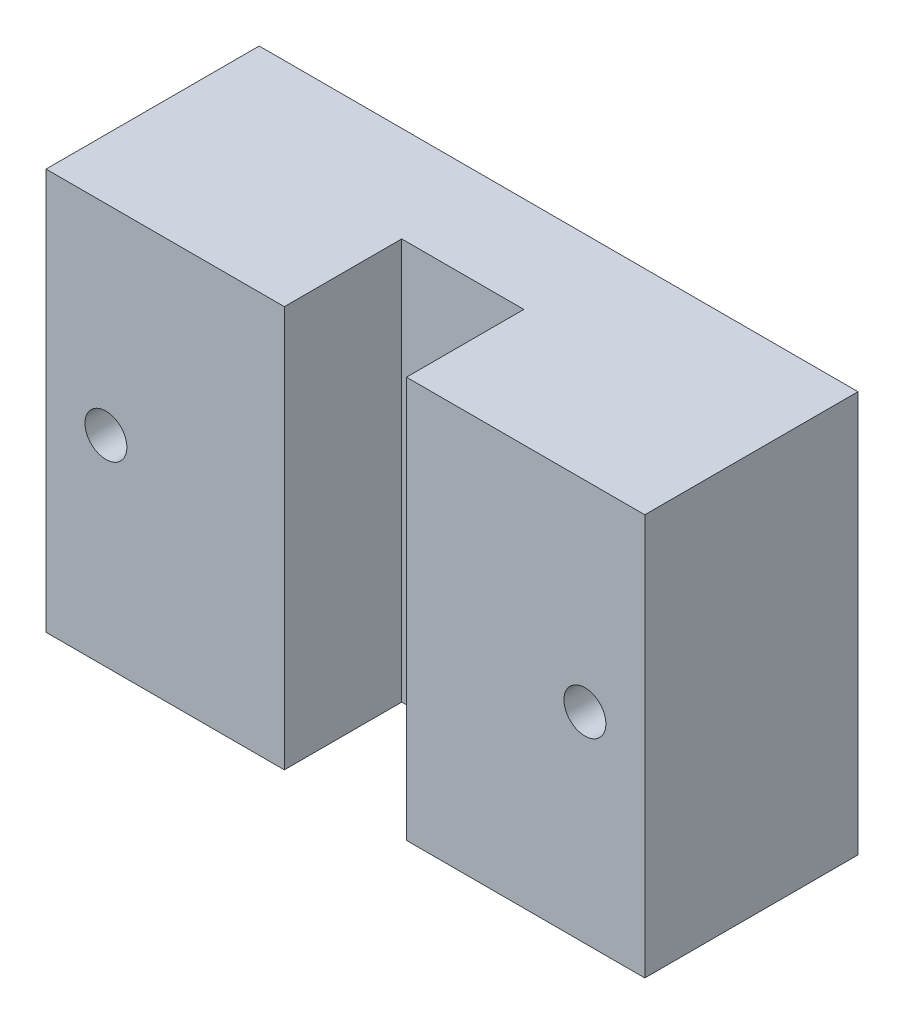
ISO-10303-21;
HEADER;
FILE_DESCRIPTION(('STEP AP214'),'2;1');
FILE_NAME('part.step','',(''),(''),'','','');
FILE_SCHEMA(('AUTOMOTIVE_DESIGN { 1 0 10303 214 1 1 1 1 }'));
ENDSEC;
DATA;
#1=APPLICATION_CONTEXT('core data for automotive mechanical design processes');
#2=APPLICATION_PROTOCOL_DEFINITION('international standard','automotive_design',2000,#1);
#3=PRODUCT_CONTEXT('',#1,'mechanical');
#4=PRODUCT('Part','Part','',(#3));
#5=PRODUCT_RELATED_PRODUCT_CATEGORY('part','',(#4));
#6=PRODUCT_DEFINITION_FORMATION('','',#4);
#7=PRODUCT_DEFINITION_CONTEXT('part definition',#1,'design');
#8=PRODUCT_DEFINITION('design','',#6,#7);
#9=PRODUCT_DEFINITION_SHAPE('','',#8);
#10=(LENGTH_UNIT() NAMED_UNIT(*) SI_UNIT(.MILLI.,.METRE.));
#11=(NAMED_UNIT(*) PLANE_ANGLE_UNIT() SI_UNIT($,.RADIAN.));
#12=(NAMED_UNIT(*) SI_UNIT($,.STERADIAN.) SOLID_ANGLE_UNIT());
#13=UNCERTAINTY_MEASURE_WITH_UNIT(LENGTH_MEASURE(1.E-05),#10,'distance_accuracy_value','');
#14=(GEOMETRIC_REPRESENTATION_CONTEXT(3) GLOBAL_UNCERTAINTY_ASSIGNED_CONTEXT((#13)) GLOBAL_UNIT_ASSIGNED_CONTEXT((#10,
#11,#12)) REPRESENTATION_CONTEXT('',''));
#15=CARTESIAN_POINT('',(0.,0.,0.));
#16=DIRECTION('',(0.,0.,1.));
#17=DIRECTION('',(1.,0.,0.));
#18=AXIS2_PLACEMENT_3D('',#15,#16,#17);
#19=CARTESIAN_POINT('',(0.,0.,8.));
#20=DIRECTION('',(0.,0.,1.));
#21=DIRECTION('',(1.,0.,0.));
#22=AXIS2_PLACEMENT_3D('',#19,#20,#21);
#23=PLANE('',#22);
#24=DIRECTION('',(0.,-1.,0.));
#25=VECTOR('',#24,1.);
#26=CARTESIAN_POINT('',(-5.1,69.8239107283418,8.));
#27=LINE('',#26,#25);
#28=CARTESIAN_POINT('',(-5.1,16.75,8.));
#29=VERTEX_POINT('',#28);
#30=CARTESIAN_POINT('',(-5.1,-16.75,8.));
#31=VERTEX_POINT('',#30);
#32=EDGE_CURVE('E55',#29,#31,#27,.T.);
#33=ORIENTED_EDGE('',*,*,#32,.T.);
#34=DIRECTION('',(1.,0.,0.));
#35=VECTOR('',#34,1.);
#36=CARTESIAN_POINT('',(25.,-16.75,8.));
#37=LINE('',#36,#35);
#38=CARTESIAN_POINT('',(5.1,-16.75,8.));
#39=VERTEX_POINT('',#38);
#40=EDGE_CURVE('E50',#31,#39,#37,.T.);
#41=ORIENTED_EDGE('',*,*,#40,.T.);
#42=DIRECTION('',(0.,-1.,0.));
#43=VECTOR('',#42,1.);
#44=CARTESIAN_POINT('',(5.1,69.8239107283418,8.));
#45=LINE('',#44,#43);
#46=CARTESIAN_POINT('',(5.1,16.75,8.));
#47=VERTEX_POINT('',#46);
#48=EDGE_CURVE('E143',#47,#39,#45,.T.);
#49=ORIENTED_EDGE('',*,*,#48,.F.);
#50=DIRECTION('',(-1.,0.,0.));
#51=VECTOR('',#50,1.);
#52=CARTESIAN_POINT('',(25.,16.75,8.));
#53=LINE('',#52,#51);
#54=EDGE_CURVE('E154',#47,#29,#53,.T.);
#55=ORIENTED_EDGE('',*,*,#54,.T.);
#56=EDGE_LOOP('',(#33,#41,#49,#55));
#57=FACE_BOUND('',#56,.T.);
#58=ADVANCED_FACE('F35',(#57),#23,.T.);
#59=CARTESIAN_POINT('',(0.,0.,0.));
#60=DIRECTION('',(0.,0.,1.));
#61=DIRECTION('',(1.,0.,0.));
#62=AXIS2_PLACEMENT_3D('',#59,#60,#61);
#63=PLANE('',#62);
#64=DIRECTION('',(0.,-1.,0.));
#65=VECTOR('',#64,1.);
#66=CARTESIAN_POINT('',(-25.,-16.75,0.));
#67=LINE('',#66,#65);
#68=CARTESIAN_POINT('',(-25.,16.75,0.));
#69=VERTEX_POINT('',#68);
#70=CARTESIAN_POINT('',(-25.,-16.75,0.));
#71=VERTEX_POINT('',#70);
#72=EDGE_CURVE('E152',#69,#71,#67,.T.);
#73=ORIENTED_EDGE('',*,*,#72,.F.);
#74=DIRECTION('',(-1.,0.,0.));
#75=VECTOR('',#74,1.);
#76=CARTESIAN_POINT('',(25.,16.75,0.));
#77=LINE('',#76,#75);
#78=CARTESIAN_POINT('',(25.,16.75,0.));
#79=VERTEX_POINT('',#78);
#80=EDGE_CURVE('E155',#79,#69,#77,.T.);
#81=ORIENTED_EDGE('',*,*,#80,.F.);
#82=DIRECTION('',(0.,1.,0.));
#83=VECTOR('',#82,1.);
#84=CARTESIAN_POINT('',(25.,-16.75,0.));
#85=LINE('',#84,#83);
#86=CARTESIAN_POINT('',(25.,-16.75,0.));
#87=VERTEX_POINT('',#86);
#88=EDGE_CURVE('E161',#87,#79,#85,.T.);
#89=ORIENTED_EDGE('',*,*,#88,.F.);
#90=DIRECTION('',(1.,0.,0.));
#91=VECTOR('',#90,1.);
#92=CARTESIAN_POINT('',(25.,-16.75,0.));
#93=LINE('',#92,#91);
#94=EDGE_CURVE('E103',#71,#87,#93,.T.);
#95=ORIENTED_EDGE('',*,*,#94,.F.);
#96=EDGE_LOOP('',(#73,#81,#89,#95));
#97=FACE_BOUND('',#96,.T.);
#98=CARTESIAN_POINT('',(-20.,0.,0.));
#99=DIRECTION('',(0.,0.,1.));
#100=DIRECTION('',(1.,0.,0.));
#101=AXIS2_PLACEMENT_3D('',#98,#99,#100);
#102=CIRCLE('',#101,1.75);
#103=CARTESIAN_POINT('',(-18.25,0.,0.));
#104=VERTEX_POINT('',#103);
#105=EDGE_CURVE('E149',#104,#104,#102,.T.);
#106=ORIENTED_EDGE('',*,*,#105,.T.);
#107=EDGE_LOOP('',(#106));
#108=FACE_BOUND('',#107,.T.);
#109=CARTESIAN_POINT('',(20.,0.,0.));
#110=DIRECTION('',(0.,0.,1.));
#111=DIRECTION('',(1.,0.,0.));
#112=AXIS2_PLACEMENT_3D('',#109,#110,#111);
#113=CIRCLE('',#112,1.75);
#114=CARTESIAN_POINT('',(21.75,0.,0.));
#115=VERTEX_POINT('',#114);
#116=EDGE_CURVE('E146',#115,#115,#113,.T.);
#117=ORIENTED_EDGE('',*,*,#116,.T.);
#118=EDGE_LOOP('',(#117));
#119=FACE_BOUND('',#118,.T.);
#120=ADVANCED_FACE('F171',(#97,#108,#119),#63,.F.);
#121=CARTESIAN_POINT('',(-25.,-16.75,8.));
#122=DIRECTION('',(1.,0.,0.));
#123=DIRECTION('',(0.,0.,-1.));
#124=AXIS2_PLACEMENT_3D('',#121,#122,#123);
#125=PLANE('',#124);
#126=ORIENTED_EDGE('',*,*,#72,.T.);
#127=DIRECTION('',(0.,0.,-1.));
#128=VECTOR('',#127,1.);
#129=CARTESIAN_POINT('',(-25.,-16.75,8.));
#130=LINE('',#129,#128);
#131=CARTESIAN_POINT('',(-25.,-16.75,17.8));
#132=VERTEX_POINT('',#131);
#133=EDGE_CURVE('E11',#132,#71,#130,.T.);
#134=ORIENTED_EDGE('',*,*,#133,.F.);
#135=DIRECTION('',(0.,-1.,0.));
#136=VECTOR('',#135,1.);
#137=CARTESIAN_POINT('',(-25.,69.8239107283418,17.8));
#138=LINE('',#137,#136);
#139=CARTESIAN_POINT('',(-25.,16.75,17.8));
#140=VERTEX_POINT('',#139);
#141=EDGE_CURVE('E136',#140,#132,#138,.T.);
#142=ORIENTED_EDGE('',*,*,#141,.F.);
#143=DIRECTION('',(0.,0.,-1.));
#144=VECTOR('',#143,1.);
#145=CARTESIAN_POINT('',(-25.,16.75,8.));
#146=LINE('',#145,#144);
#147=EDGE_CURVE('E157',#140,#69,#146,.T.);
#148=ORIENTED_EDGE('',*,*,#147,.T.);
#149=EDGE_LOOP('',(#126,#134,#142,#148));
#150=FACE_BOUND('',#149,.T.);
#151=ADVANCED_FACE('F37',(#150),#125,.F.);
#152=CARTESIAN_POINT('',(25.,-16.75,8.));
#153=DIRECTION('',(0.,1.,0.));
#154=DIRECTION('',(-1.,0.,0.));
#155=AXIS2_PLACEMENT_3D('',#152,#153,#154);
#156=PLANE('',#155);
#157=ORIENTED_EDGE('',*,*,#94,.T.);
#158=DIRECTION('',(0.,0.,-1.));
#159=VECTOR('',#158,1.);
#160=CARTESIAN_POINT('',(25.,-16.75,8.));
#161=LINE('',#160,#159);
#162=CARTESIAN_POINT('',(25.,-16.75,17.8));
#163=VERTEX_POINT('',#162);
#164=EDGE_CURVE('E43',#163,#87,#161,.T.);
#165=ORIENTED_EDGE('',*,*,#164,.F.);
#166=DIRECTION('',(-1.,0.,0.));
#167=VECTOR('',#166,1.);
#168=CARTESIAN_POINT('',(5.1,-16.75,17.8));
#169=LINE('',#168,#167);
#170=CARTESIAN_POINT('',(5.1,-16.75,17.8));
#171=VERTEX_POINT('',#170);
#172=EDGE_CURVE('E102',#163,#171,#169,.T.);
#173=ORIENTED_EDGE('',*,*,#172,.T.);
#174=DIRECTION('',(0.,0.,-1.));
#175=VECTOR('',#174,1.);
#176=CARTESIAN_POINT('',(5.1,-16.75,8.));
#177=LINE('',#176,#175);
#178=EDGE_CURVE('E120',#171,#39,#177,.T.);
#179=ORIENTED_EDGE('',*,*,#178,.T.);
#180=ORIENTED_EDGE('',*,*,#40,.F.);
#181=DIRECTION('',(0.,0.,1.));
#182=VECTOR('',#181,1.);
#183=CARTESIAN_POINT('',(-5.1,-16.75,17.8));
#184=LINE('',#183,#182);
#185=CARTESIAN_POINT('',(-5.1,-16.75,17.8));
#186=VERTEX_POINT('',#185);
#187=EDGE_CURVE('E123',#31,#186,#184,.T.);
#188=ORIENTED_EDGE('',*,*,#187,.T.);
#189=DIRECTION('',(-1.,0.,0.));
#190=VECTOR('',#189,1.);
#191=CARTESIAN_POINT('',(-25.,-16.75,17.8));
#192=LINE('',#191,#190);
#193=EDGE_CURVE('E115',#186,#132,#192,.T.);
#194=ORIENTED_EDGE('',*,*,#193,.T.);
#195=ORIENTED_EDGE('',*,*,#133,.T.);
#196=EDGE_LOOP('',(#157,#165,#173,#179,#180,#188,#194,#195));
#197=FACE_BOUND('',#196,.T.);
#198=ADVANCED_FACE('F99',(#197),#156,.F.);
#199=CARTESIAN_POINT('',(25.,-16.75,8.));
#200=DIRECTION('',(-1.,0.,0.));
#201=DIRECTION('',(0.,0.,1.));
#202=AXIS2_PLACEMENT_3D('',#199,#200,#201);
#203=PLANE('',#202);
#204=ORIENTED_EDGE('',*,*,#88,.T.);
#205=DIRECTION('',(0.,0.,-1.));
#206=VECTOR('',#205,1.);
#207=CARTESIAN_POINT('',(25.,16.75,8.));
#208=LINE('',#207,#206);
#209=CARTESIAN_POINT('',(25.,16.75,17.8));
#210=VERTEX_POINT('',#209);
#211=EDGE_CURVE('E106',#210,#79,#208,.T.);
#212=ORIENTED_EDGE('',*,*,#211,.F.);
#213=DIRECTION('',(0.,-1.,0.));
#214=VECTOR('',#213,1.);
#215=CARTESIAN_POINT('',(25.,69.8239107283418,17.8));
#216=LINE('',#215,#214);
#217=EDGE_CURVE('E108',#210,#163,#216,.T.);
#218=ORIENTED_EDGE('',*,*,#217,.T.);
#219=ORIENTED_EDGE('',*,*,#164,.T.);
#220=EDGE_LOOP('',(#204,#212,#218,#219));
#221=FACE_BOUND('',#220,.T.);
#222=ADVANCED_FACE('F109',(#221),#203,.F.);
#223=CARTESIAN_POINT('',(25.,16.75,8.));
#224=DIRECTION('',(0.,-1.,0.));
#225=DIRECTION('',(1.,0.,0.));
#226=AXIS2_PLACEMENT_3D('',#223,#224,#225);
#227=PLANE('',#226);
#228=ORIENTED_EDGE('',*,*,#80,.T.);
#229=ORIENTED_EDGE('',*,*,#147,.F.);
#230=DIRECTION('',(1.,0.,0.));
#231=VECTOR('',#230,1.);
#232=CARTESIAN_POINT('',(-25.,16.75,17.8));
#233=LINE('',#232,#231);
#234=CARTESIAN_POINT('',(-5.1,16.75,17.8));
#235=VERTEX_POINT('',#234);
#236=EDGE_CURVE('E129',#140,#235,#233,.T.);
#237=ORIENTED_EDGE('',*,*,#236,.T.);
#238=DIRECTION('',(0.,0.,-1.));
#239=VECTOR('',#238,1.);
#240=CARTESIAN_POINT('',(-5.1,16.75,17.8));
#241=LINE('',#240,#239);
#242=EDGE_CURVE('E182',#235,#29,#241,.T.);
#243=ORIENTED_EDGE('',*,*,#242,.T.);
#244=ORIENTED_EDGE('',*,*,#54,.F.);
#245=DIRECTION('',(0.,0.,1.));
#246=VECTOR('',#245,1.);
#247=CARTESIAN_POINT('',(5.1,16.75,8.));
#248=LINE('',#247,#246);
#249=CARTESIAN_POINT('',(5.09999999999999,16.75,17.8));
#250=VERTEX_POINT('',#249);
#251=EDGE_CURVE('E183',#47,#250,#248,.T.);
#252=ORIENTED_EDGE('',*,*,#251,.T.);
#253=DIRECTION('',(1.,0.,0.));
#254=VECTOR('',#253,1.);
#255=CARTESIAN_POINT('',(5.1,16.75,17.8));
#256=LINE('',#255,#254);
#257=EDGE_CURVE('E139',#250,#210,#256,.T.);
#258=ORIENTED_EDGE('',*,*,#257,.T.);
#259=ORIENTED_EDGE('',*,*,#211,.T.);
#260=EDGE_LOOP('',(#228,#229,#237,#243,#244,#252,#258,#259));
#261=FACE_BOUND('',#260,.T.);
#262=ADVANCED_FACE('F168',(#261),#227,.F.);
#263=CARTESIAN_POINT('',(-20.,0.,8.));
#264=DIRECTION('',(0.,0.,-1.));
#265=DIRECTION('',(-1.,0.,0.));
#266=AXIS2_PLACEMENT_3D('',#263,#264,#265);
#267=CYLINDRICAL_SURFACE('',#266,1.75);
#268=ORIENTED_EDGE('',*,*,#105,.F.);
#269=EDGE_LOOP('',(#268));
#270=FACE_BOUND('',#269,.T.);
#271=CARTESIAN_POINT('',(-20.,0.,17.8));
#272=DIRECTION('',(0.,0.,-1.));
#273=DIRECTION('',(-1.,0.,0.));
#274=AXIS2_PLACEMENT_3D('',#271,#272,#273);
#275=CIRCLE('',#274,1.75);
#276=CARTESIAN_POINT('',(-21.75,0.,17.8));
#277=VERTEX_POINT('',#276);
#278=EDGE_CURVE('E121',#277,#277,#275,.T.);
#279=ORIENTED_EDGE('',*,*,#278,.F.);
#280=EDGE_LOOP('',(#279));
#281=FACE_BOUND('',#280,.T.);
#282=ADVANCED_FACE('F194',(#270,#281),#267,.F.);
#283=CARTESIAN_POINT('',(20.,0.,8.));
#284=DIRECTION('',(0.,0.,-1.));
#285=DIRECTION('',(-1.,0.,0.));
#286=AXIS2_PLACEMENT_3D('',#283,#284,#285);
#287=CYLINDRICAL_SURFACE('',#286,1.75);
#288=ORIENTED_EDGE('',*,*,#116,.F.);
#289=EDGE_LOOP('',(#288));
#290=FACE_BOUND('',#289,.T.);
#291=CARTESIAN_POINT('',(20.,0.,17.8));
#292=DIRECTION('',(0.,0.,-1.));
#293=DIRECTION('',(-1.,0.,0.));
#294=AXIS2_PLACEMENT_3D('',#291,#292,#293);
#295=CIRCLE('',#294,1.75);
#296=CARTESIAN_POINT('',(18.25,0.,17.8));
#297=VERTEX_POINT('',#296);
#298=EDGE_CURVE('E126',#297,#297,#295,.T.);
#299=ORIENTED_EDGE('',*,*,#298,.F.);
#300=EDGE_LOOP('',(#299));
#301=FACE_BOUND('',#300,.T.);
#302=ADVANCED_FACE('F192',(#290,#301),#287,.F.);
#303=CARTESIAN_POINT('',(5.09999999999999,69.8239107283418,17.8));
#304=DIRECTION('',(0.,0.,1.));
#305=DIRECTION('',(1.,0.,0.));
#306=AXIS2_PLACEMENT_3D('',#303,#304,#305);
#307=PLANE('',#306);
#308=ORIENTED_EDGE('',*,*,#298,.T.);
#309=EDGE_LOOP('',(#308));
#310=FACE_BOUND('',#309,.T.);
#311=ORIENTED_EDGE('',*,*,#257,.F.);
#312=DIRECTION('',(0.,-1.,0.));
#313=VECTOR('',#312,1.);
#314=CARTESIAN_POINT('',(5.09999999999999,69.8239107283418,17.8));
#315=LINE('',#314,#313);
#316=EDGE_CURVE('E114',#250,#171,#315,.T.);
#317=ORIENTED_EDGE('',*,*,#316,.T.);
#318=ORIENTED_EDGE('',*,*,#172,.F.);
#319=ORIENTED_EDGE('',*,*,#217,.F.);
#320=EDGE_LOOP('',(#311,#317,#318,#319));
#321=FACE_BOUND('',#320,.T.);
#322=ADVANCED_FACE('F117',(#310,#321),#307,.T.);
#323=CARTESIAN_POINT('',(5.1,69.8239107283418,8.));
#324=DIRECTION('',(-1.,0.,0.));
#325=DIRECTION('',(0.,0.,1.));
#326=AXIS2_PLACEMENT_3D('',#323,#324,#325);
#327=PLANE('',#326);
#328=ORIENTED_EDGE('',*,*,#251,.F.);
#329=ORIENTED_EDGE('',*,*,#48,.T.);
#330=ORIENTED_EDGE('',*,*,#178,.F.);
#331=ORIENTED_EDGE('',*,*,#316,.F.);
#332=EDGE_LOOP('',(#328,#329,#330,#331));
#333=FACE_BOUND('',#332,.T.);
#334=ADVANCED_FACE('F201',(#333),#327,.T.);
#335=CARTESIAN_POINT('',(-25.,69.8239107283418,17.8));
#336=DIRECTION('',(0.,0.,1.));
#337=DIRECTION('',(1.,0.,0.));
#338=AXIS2_PLACEMENT_3D('',#335,#336,#337);
#339=PLANE('',#338);
#340=ORIENTED_EDGE('',*,*,#278,.T.);
#341=EDGE_LOOP('',(#340));
#342=FACE_BOUND('',#341,.T.);
#343=ORIENTED_EDGE('',*,*,#236,.F.);
#344=ORIENTED_EDGE('',*,*,#141,.T.);
#345=ORIENTED_EDGE('',*,*,#193,.F.);
#346=DIRECTION('',(0.,-1.,0.));
#347=VECTOR('',#346,1.);
#348=CARTESIAN_POINT('',(-5.1,69.8239107283418,17.8));
#349=LINE('',#348,#347);
#350=EDGE_CURVE('E140',#235,#186,#349,.T.);
#351=ORIENTED_EDGE('',*,*,#350,.F.);
#352=EDGE_LOOP('',(#343,#344,#345,#351));
#353=FACE_BOUND('',#352,.T.);
#354=ADVANCED_FACE('F180',(#342,#353),#339,.T.);
#355=CARTESIAN_POINT('',(-5.1,69.8239107283418,17.8));
#356=DIRECTION('',(1.,0.,0.));
#357=DIRECTION('',(0.,0.,-1.));
#358=AXIS2_PLACEMENT_3D('',#355,#356,#357);
#359=PLANE('',#358);
#360=ORIENTED_EDGE('',*,*,#242,.F.);
#361=ORIENTED_EDGE('',*,*,#350,.T.);
#362=ORIENTED_EDGE('',*,*,#187,.F.);
#363=ORIENTED_EDGE('',*,*,#32,.F.);
#364=EDGE_LOOP('',(#360,#361,#362,#363));
#365=FACE_BOUND('',#364,.T.);
#366=ADVANCED_FACE('F284',(#365),#359,.T.);
#367=CLOSED_SHELL('',(#58,#120,#151,#198,#222,#262,#282,#302,#322,#334,#354,#366));
#368=MANIFOLD_SOLID_BREP('B2',#367);
#369=ADVANCED_BREP_SHAPE_REPRESENTATION('',(#18,#368),#14);
#370=SHAPE_DEFINITION_REPRESENTATION(#9,#369);
ENDSEC;
END-ISO-10303-21;
